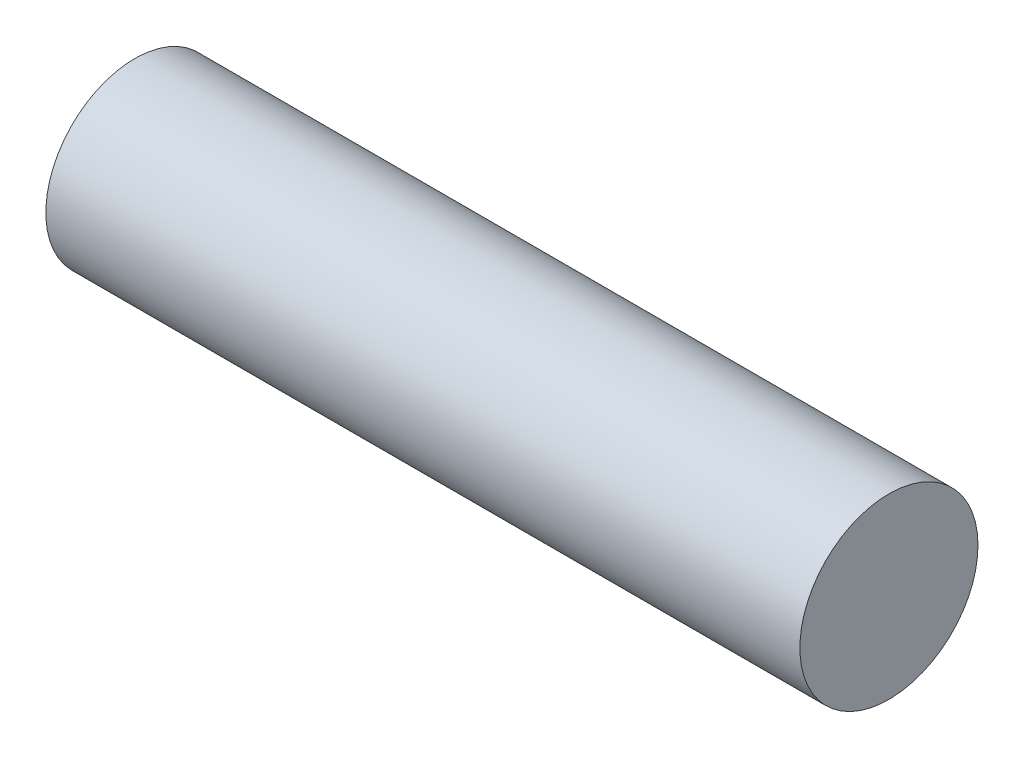
ISO-10303-21;
HEADER;
FILE_DESCRIPTION(('STEP AP214'),'2;1');
FILE_NAME('part.step','',(''),(''),'','','');
FILE_SCHEMA(('AUTOMOTIVE_DESIGN { 1 0 10303 214 1 1 1 1 }'));
ENDSEC;
DATA;
#1=APPLICATION_CONTEXT('core data for automotive mechanical design processes');
#2=APPLICATION_PROTOCOL_DEFINITION('international standard','automotive_design',2000,#1);
#3=PRODUCT_CONTEXT('',#1,'mechanical');
#4=PRODUCT('Part','Part','',(#3));
#5=PRODUCT_RELATED_PRODUCT_CATEGORY('part','',(#4));
#6=PRODUCT_DEFINITION_FORMATION('','',#4);
#7=PRODUCT_DEFINITION_CONTEXT('part definition',#1,'design');
#8=PRODUCT_DEFINITION('design','',#6,#7);
#9=PRODUCT_DEFINITION_SHAPE('','',#8);
#10=(LENGTH_UNIT() NAMED_UNIT(*) SI_UNIT(.MILLI.,.METRE.));
#11=(NAMED_UNIT(*) PLANE_ANGLE_UNIT() SI_UNIT($,.RADIAN.));
#12=(NAMED_UNIT(*) SI_UNIT($,.STERADIAN.) SOLID_ANGLE_UNIT());
#13=UNCERTAINTY_MEASURE_WITH_UNIT(LENGTH_MEASURE(1.E-05),#10,'distance_accuracy_value','');
#14=(GEOMETRIC_REPRESENTATION_CONTEXT(3) GLOBAL_UNCERTAINTY_ASSIGNED_CONTEXT((#13)) GLOBAL_UNIT_ASSIGNED_CONTEXT((#10,
#11,#12)) REPRESENTATION_CONTEXT('',''));
#15=CARTESIAN_POINT('',(0.,0.,0.));
#16=DIRECTION('',(0.,0.,1.));
#17=DIRECTION('',(1.,0.,0.));
#18=AXIS2_PLACEMENT_3D('',#15,#16,#17);
#19=CARTESIAN_POINT('',(-50.8,0.,0.));
#20=DIRECTION('',(1.,0.,0.));
#21=DIRECTION('',(0.,0.,-1.));
#22=AXIS2_PLACEMENT_3D('',#19,#20,#21);
#23=CYLINDRICAL_SURFACE('',#22,6.);
#24=CARTESIAN_POINT('',(-50.8,0.,0.));
#25=DIRECTION('',(1.,0.,0.));
#26=DIRECTION('',(0.,0.,-1.));
#27=AXIS2_PLACEMENT_3D('',#24,#25,#26);
#28=CIRCLE('',#27,6.);
#29=CARTESIAN_POINT('',(-50.8,0.,-6.));
#30=VERTEX_POINT('',#29);
#31=EDGE_CURVE('E10',#30,#30,#28,.T.);
#32=ORIENTED_EDGE('',*,*,#31,.T.);
#33=EDGE_LOOP('',(#32));
#34=FACE_BOUND('',#33,.T.);
#35=CARTESIAN_POINT('',(0.,0.,0.));
#36=DIRECTION('',(1.,0.,0.));
#37=DIRECTION('',(0.,0.,-1.));
#38=AXIS2_PLACEMENT_3D('',#35,#36,#37);
#39=CIRCLE('',#38,6.);
#40=CARTESIAN_POINT('',(0.,0.,-6.));
#41=VERTEX_POINT('',#40);
#42=EDGE_CURVE('E34',#41,#41,#39,.T.);
#43=ORIENTED_EDGE('',*,*,#42,.F.);
#44=EDGE_LOOP('',(#43));
#45=FACE_BOUND('',#44,.T.);
#46=ADVANCED_FACE('F31',(#34,#45),#23,.T.);
#47=CARTESIAN_POINT('',(-50.8,0.,0.));
#48=DIRECTION('',(1.,0.,0.));
#49=DIRECTION('',(0.,0.,-1.));
#50=AXIS2_PLACEMENT_3D('',#47,#48,#49);
#51=PLANE('',#50);
#52=ORIENTED_EDGE('',*,*,#31,.F.);
#53=EDGE_LOOP('',(#52));
#54=FACE_BOUND('',#53,.T.);
#55=ADVANCED_FACE('F46',(#54),#51,.F.);
#56=CARTESIAN_POINT('',(0.,0.,0.));
#57=DIRECTION('',(1.,0.,0.));
#58=DIRECTION('',(0.,0.,-1.));
#59=AXIS2_PLACEMENT_3D('',#56,#57,#58);
#60=PLANE('',#59);
#61=ORIENTED_EDGE('',*,*,#42,.T.);
#62=EDGE_LOOP('',(#61));
#63=FACE_BOUND('',#62,.T.);
#64=ADVANCED_FACE('F43',(#63),#60,.T.);
#65=CLOSED_SHELL('',(#46,#55,#64));
#66=MANIFOLD_SOLID_BREP('B2',#65);
#67=ADVANCED_BREP_SHAPE_REPRESENTATION('',(#18,#66),#14);
#68=SHAPE_DEFINITION_REPRESENTATION(#9,#67);
ENDSEC;
END-ISO-10303-21;
